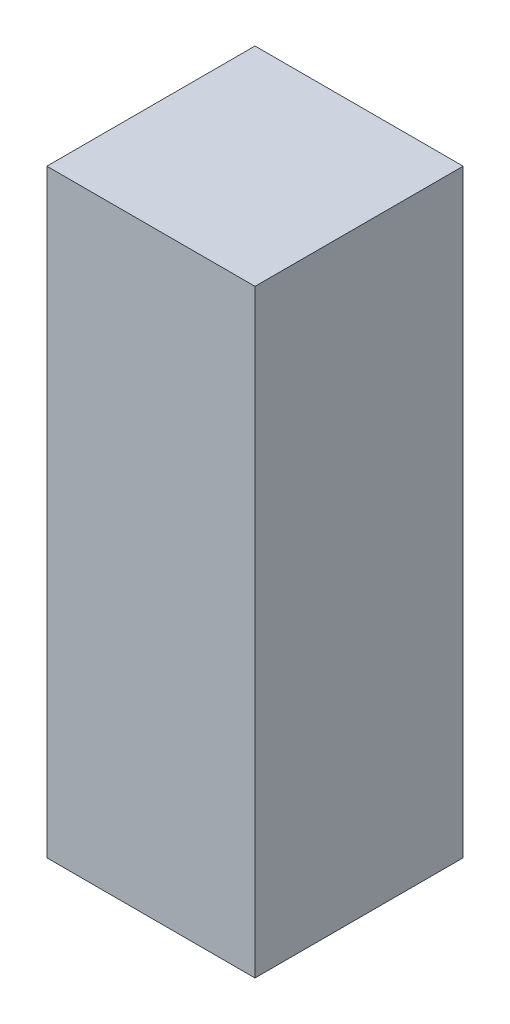
ISO-10303-21;
HEADER;
FILE_DESCRIPTION(('STEP AP214'),'2;1');
FILE_NAME('part.step','',(''),(''),'','','');
FILE_SCHEMA(('AUTOMOTIVE_DESIGN { 1 0 10303 214 1 1 1 1 }'));
ENDSEC;
DATA;
#1=APPLICATION_CONTEXT('core data for automotive mechanical design processes');
#2=APPLICATION_PROTOCOL_DEFINITION('international standard','automotive_design',2000,#1);
#3=PRODUCT_CONTEXT('',#1,'mechanical');
#4=PRODUCT('Part','Part','',(#3));
#5=PRODUCT_RELATED_PRODUCT_CATEGORY('part','',(#4));
#6=PRODUCT_DEFINITION_FORMATION('','',#4);
#7=PRODUCT_DEFINITION_CONTEXT('part definition',#1,'design');
#8=PRODUCT_DEFINITION('design','',#6,#7);
#9=PRODUCT_DEFINITION_SHAPE('','',#8);
#10=(LENGTH_UNIT() NAMED_UNIT(*) SI_UNIT(.MILLI.,.METRE.));
#11=(NAMED_UNIT(*) PLANE_ANGLE_UNIT() SI_UNIT($,.RADIAN.));
#12=(NAMED_UNIT(*) SI_UNIT($,.STERADIAN.) SOLID_ANGLE_UNIT());
#13=UNCERTAINTY_MEASURE_WITH_UNIT(LENGTH_MEASURE(1.E-05),#10,'distance_accuracy_value','');
#14=(GEOMETRIC_REPRESENTATION_CONTEXT(3) GLOBAL_UNCERTAINTY_ASSIGNED_CONTEXT((#13)) GLOBAL_UNIT_ASSIGNED_CONTEXT((#10,
#11,#12)) REPRESENTATION_CONTEXT('',''));
#15=CARTESIAN_POINT('',(0.,0.,0.));
#16=DIRECTION('',(0.,0.,1.));
#17=DIRECTION('',(1.,0.,0.));
#18=AXIS2_PLACEMENT_3D('',#15,#16,#17);
#19=CARTESIAN_POINT('',(-2.4384,-3.3909,-5.21335));
#20=DIRECTION('',(0.,-0.707106781186549,-0.707106781186546));
#21=DIRECTION('',(0.,0.707106781186546,-0.707106781186549));
#22=AXIS2_PLACEMENT_3D('',#19,#20,#21);
#23=PLANE('',#22);
#24=DIRECTION('',(1.,0.,0.));
#25=VECTOR('',#24,1.);
#26=CARTESIAN_POINT('',(-2.27965,-3.4544,-5.14985));
#27=LINE('',#26,#25);
#28=CARTESIAN_POINT('',(-2.47015,-3.4544,-5.14985));
#29=VERTEX_POINT('',#28);
#30=CARTESIAN_POINT('',(-2.08915,-3.4544,-5.14985));
#31=VERTEX_POINT('',#30);
#32=EDGE_CURVE('E20',#29,#31,#27,.T.);
#33=ORIENTED_EDGE('',*,*,#32,.F.);
#34=DIRECTION('',(0.577350269189627,-0.577350269189627,0.577350269189623));
#35=VECTOR('',#34,1.);
#36=CARTESIAN_POINT('',(-2.59715,-3.3274,-5.27685));
#37=LINE('',#36,#35);
#38=CARTESIAN_POINT('',(-2.59715,-3.3274,-5.27685));
#39=VERTEX_POINT('',#38);
#40=EDGE_CURVE('E71',#39,#29,#37,.T.);
#41=ORIENTED_EDGE('',*,*,#40,.F.);
#42=DIRECTION('',(-1.,0.,0.));
#43=VECTOR('',#42,1.);
#44=CARTESIAN_POINT('',(-2.59715,-3.3274,-5.27685));
#45=LINE('',#44,#43);
#46=CARTESIAN_POINT('',(-1.96215,-3.3274,-5.27685));
#47=VERTEX_POINT('',#46);
#48=EDGE_CURVE('E92',#47,#39,#45,.T.);
#49=ORIENTED_EDGE('',*,*,#48,.F.);
#50=DIRECTION('',(0.577350269189628,0.577350269189626,-0.577350269189624));
#51=VECTOR('',#50,1.);
#52=CARTESIAN_POINT('',(-2.08915,-3.4544,-5.14985));
#53=LINE('',#52,#51);
#54=EDGE_CURVE('E73',#31,#47,#53,.T.);
#55=ORIENTED_EDGE('',*,*,#54,.F.);
#56=EDGE_LOOP('',(#33,#41,#49,#55));
#57=FACE_BOUND('',#56,.T.);
#58=ADVANCED_FACE('F17',(#57),#23,.T.);
#59=CARTESIAN_POINT('',(-2.27965,-3.4544,-4.95935));
#60=DIRECTION('',(0.,-1.,0.));
#61=DIRECTION('',(0.,0.,-1.));
#62=AXIS2_PLACEMENT_3D('',#59,#60,#61);
#63=PLANE('',#62);
#64=DIRECTION('',(0.,0.,1.));
#65=VECTOR('',#64,1.);
#66=CARTESIAN_POINT('',(-2.08915,-3.4544,-5.1181));
#67=LINE('',#66,#65);
#68=CARTESIAN_POINT('',(-2.08915,-3.4544,-4.76885));
#69=VERTEX_POINT('',#68);
#70=EDGE_CURVE('E87',#69,#31,#67,.F.);
#71=ORIENTED_EDGE('',*,*,#70,.F.);
#72=DIRECTION('',(1.,0.,0.));
#73=VECTOR('',#72,1.);
#74=CARTESIAN_POINT('',(-2.1209,-3.4544,-4.76885));
#75=LINE('',#74,#73);
#76=CARTESIAN_POINT('',(-2.47015,-3.4544,-4.76885));
#77=VERTEX_POINT('',#76);
#78=EDGE_CURVE('E79',#77,#69,#75,.T.);
#79=ORIENTED_EDGE('',*,*,#78,.F.);
#80=DIRECTION('',(0.,0.,1.));
#81=VECTOR('',#80,1.);
#82=CARTESIAN_POINT('',(-2.47015,-3.4544,-4.8006));
#83=LINE('',#82,#81);
#84=EDGE_CURVE('E75',#29,#77,#83,.T.);
#85=ORIENTED_EDGE('',*,*,#84,.F.);
#86=ORIENTED_EDGE('',*,*,#32,.T.);
#87=EDGE_LOOP('',(#71,#79,#85,#86));
#88=FACE_BOUND('',#87,.T.);
#89=ADVANCED_FACE('F77',(#88),#63,.T.);
#90=CARTESIAN_POINT('',(-2.53365,-3.3909,-4.8006));
#91=DIRECTION('',(-0.707106781186548,-0.707106781186548,0.));
#92=DIRECTION('',(0.707106781186548,-0.707106781186548,0.));
#93=AXIS2_PLACEMENT_3D('',#90,#91,#92);
#94=PLANE('',#93);
#95=DIRECTION('',(0.,0.,1.));
#96=VECTOR('',#95,1.);
#97=CARTESIAN_POINT('',(-2.59715,-3.3274,-4.64185));
#98=LINE('',#97,#96);
#99=CARTESIAN_POINT('',(-2.59715,-3.3274,-4.64185));
#100=VERTEX_POINT('',#99);
#101=EDGE_CURVE('E85',#39,#100,#98,.T.);
#102=ORIENTED_EDGE('',*,*,#101,.F.);
#103=ORIENTED_EDGE('',*,*,#40,.T.);
#104=ORIENTED_EDGE('',*,*,#84,.T.);
#105=DIRECTION('',(0.577350269189628,-0.577350269189626,-0.577350269189624));
#106=VECTOR('',#105,1.);
#107=CARTESIAN_POINT('',(-2.59715,-3.3274,-4.64185));
#108=LINE('',#107,#106);
#109=EDGE_CURVE('E105',#100,#77,#108,.T.);
#110=ORIENTED_EDGE('',*,*,#109,.F.);
#111=EDGE_LOOP('',(#102,#103,#104,#110));
#112=FACE_BOUND('',#111,.T.);
#113=ADVANCED_FACE('F83',(#112),#94,.T.);
#114=CARTESIAN_POINT('',(-2.02565,-3.3909,-5.1181));
#115=DIRECTION('',(0.707106781186548,-0.707106781186548,0.));
#116=DIRECTION('',(0.707106781186548,0.707106781186548,0.));
#117=AXIS2_PLACEMENT_3D('',#114,#115,#116);
#118=PLANE('',#117);
#119=DIRECTION('',(0.,0.,-1.));
#120=VECTOR('',#119,1.);
#121=CARTESIAN_POINT('',(-1.96215,-3.3274,-5.27685));
#122=LINE('',#121,#120);
#123=CARTESIAN_POINT('',(-1.96215,-3.3274,-4.64185));
#124=VERTEX_POINT('',#123);
#125=EDGE_CURVE('E35',#124,#47,#122,.T.);
#126=ORIENTED_EDGE('',*,*,#125,.F.);
#127=DIRECTION('',(0.577350269189626,0.577350269189626,0.577350269189624));
#128=VECTOR('',#127,1.);
#129=CARTESIAN_POINT('',(-2.08915,-3.4544,-4.76885));
#130=LINE('',#129,#128);
#131=EDGE_CURVE('E103',#69,#124,#130,.T.);
#132=ORIENTED_EDGE('',*,*,#131,.F.);
#133=ORIENTED_EDGE('',*,*,#70,.T.);
#134=ORIENTED_EDGE('',*,*,#54,.T.);
#135=EDGE_LOOP('',(#126,#132,#133,#134));
#136=FACE_BOUND('',#135,.T.);
#137=ADVANCED_FACE('F139',(#136),#118,.T.);
#138=CARTESIAN_POINT('',(-2.59715,0.127,-5.27685));
#139=DIRECTION('',(0.,0.,-1.));
#140=DIRECTION('',(-1.,0.,0.));
#141=AXIS2_PLACEMENT_3D('',#138,#139,#140);
#142=PLANE('',#141);
#143=ORIENTED_EDGE('',*,*,#48,.T.);
#144=DIRECTION('',(0.,1.,0.));
#145=VECTOR('',#144,1.);
#146=CARTESIAN_POINT('',(-2.59715,0.127,-5.27685));
#147=LINE('',#146,#145);
#148=CARTESIAN_POINT('',(-2.59715,-1.4999999594414,-5.27685));
#149=VERTEX_POINT('',#148);
#150=EDGE_CURVE('E99',#149,#39,#147,.F.);
#151=ORIENTED_EDGE('',*,*,#150,.F.);
#152=DIRECTION('',(1.,0.,0.));
#153=VECTOR('',#152,1.);
#154=CARTESIAN_POINT('',(36.5829594414537,-1.4999999594414,-5.27685));
#155=LINE('',#154,#153);
#156=CARTESIAN_POINT('',(-1.96215,-1.4999999594414,-5.27685));
#157=VERTEX_POINT('',#156);
#158=EDGE_CURVE('E94',#149,#157,#155,.T.);
#159=ORIENTED_EDGE('',*,*,#158,.T.);
#160=DIRECTION('',(0.,1.,0.));
#161=VECTOR('',#160,1.);
#162=CARTESIAN_POINT('',(-1.96215,0.127,-5.27685));
#163=LINE('',#162,#161);
#164=EDGE_CURVE('E111',#47,#157,#163,.T.);
#165=ORIENTED_EDGE('',*,*,#164,.F.);
#166=EDGE_LOOP('',(#143,#151,#159,#165));
#167=FACE_BOUND('',#166,.T.);
#168=ADVANCED_FACE('F138',(#167),#142,.T.);
#169=CARTESIAN_POINT('',(36.5829594414537,-1.4999999594414,-7.17049999999999));
#170=DIRECTION('',(0.,-1.,0.));
#171=DIRECTION('',(0.,0.,-1.));
#172=AXIS2_PLACEMENT_3D('',#169,#170,#171);
#173=PLANE('',#172);
#174=DIRECTION('',(0.,0.,1.));
#175=VECTOR('',#174,1.);
#176=CARTESIAN_POINT('',(-2.59715,-1.4999999594414,-4.64185));
#177=LINE('',#176,#175);
#178=CARTESIAN_POINT('',(-2.59715,-1.4999999594414,-4.64185));
#179=VERTEX_POINT('',#178);
#180=EDGE_CURVE('E96',#179,#149,#177,.F.);
#181=ORIENTED_EDGE('',*,*,#180,.F.);
#182=DIRECTION('',(1.,0.,0.));
#183=VECTOR('',#182,1.);
#184=CARTESIAN_POINT('',(-1.96215,-1.4999999594414,-4.64185));
#185=LINE('',#184,#183);
#186=CARTESIAN_POINT('',(-1.96215,-1.4999999594414,-4.64185));
#187=VERTEX_POINT('',#186);
#188=EDGE_CURVE('E114',#187,#179,#185,.F.);
#189=ORIENTED_EDGE('',*,*,#188,.F.);
#190=DIRECTION('',(0.,0.,-1.));
#191=VECTOR('',#190,1.);
#192=CARTESIAN_POINT('',(-1.96215,-1.4999999594414,-5.27685));
#193=LINE('',#192,#191);
#194=EDGE_CURVE('E107',#157,#187,#193,.F.);
#195=ORIENTED_EDGE('',*,*,#194,.F.);
#196=ORIENTED_EDGE('',*,*,#158,.F.);
#197=EDGE_LOOP('',(#181,#189,#195,#196));
#198=FACE_BOUND('',#197,.T.);
#199=ADVANCED_FACE('F133',(#198),#173,.F.);
#200=CARTESIAN_POINT('',(-2.59715,0.127,-4.64185));
#201=DIRECTION('',(-1.,0.,0.));
#202=DIRECTION('',(0.,0.,1.));
#203=AXIS2_PLACEMENT_3D('',#200,#201,#202);
#204=PLANE('',#203);
#205=ORIENTED_EDGE('',*,*,#101,.T.);
#206=DIRECTION('',(0.,1.,0.));
#207=VECTOR('',#206,1.);
#208=CARTESIAN_POINT('',(-2.59715,0.127,-4.64185));
#209=LINE('',#208,#207);
#210=EDGE_CURVE('E117',#179,#100,#209,.F.);
#211=ORIENTED_EDGE('',*,*,#210,.F.);
#212=ORIENTED_EDGE('',*,*,#180,.T.);
#213=ORIENTED_EDGE('',*,*,#150,.T.);
#214=EDGE_LOOP('',(#205,#211,#212,#213));
#215=FACE_BOUND('',#214,.T.);
#216=ADVANCED_FACE('F136',(#215),#204,.T.);
#217=CARTESIAN_POINT('',(-2.1209,-3.3909,-4.70535));
#218=DIRECTION('',(0.,-0.707106781186548,0.707106781186548));
#219=DIRECTION('',(0.,-0.707106781186548,-0.707106781186548));
#220=AXIS2_PLACEMENT_3D('',#217,#218,#219);
#221=PLANE('',#220);
#222=DIRECTION('',(1.,0.,0.));
#223=VECTOR('',#222,1.);
#224=CARTESIAN_POINT('',(-1.96215,-3.3274,-4.64185));
#225=LINE('',#224,#223);
#226=EDGE_CURVE('E26',#100,#124,#225,.T.);
#227=ORIENTED_EDGE('',*,*,#226,.F.);
#228=ORIENTED_EDGE('',*,*,#109,.T.);
#229=ORIENTED_EDGE('',*,*,#78,.T.);
#230=ORIENTED_EDGE('',*,*,#131,.T.);
#231=EDGE_LOOP('',(#227,#228,#229,#230));
#232=FACE_BOUND('',#231,.T.);
#233=ADVANCED_FACE('F127',(#232),#221,.T.);
#234=CARTESIAN_POINT('',(-1.96215,0.127,-5.27685));
#235=DIRECTION('',(1.,0.,0.));
#236=DIRECTION('',(0.,0.,-1.));
#237=AXIS2_PLACEMENT_3D('',#234,#235,#236);
#238=PLANE('',#237);
#239=ORIENTED_EDGE('',*,*,#125,.T.);
#240=ORIENTED_EDGE('',*,*,#164,.T.);
#241=ORIENTED_EDGE('',*,*,#194,.T.);
#242=DIRECTION('',(0.,1.,0.));
#243=VECTOR('',#242,1.);
#244=CARTESIAN_POINT('',(-1.96215,0.127,-4.64185));
#245=LINE('',#244,#243);
#246=EDGE_CURVE('E11',#124,#187,#245,.T.);
#247=ORIENTED_EDGE('',*,*,#246,.F.);
#248=EDGE_LOOP('',(#239,#240,#241,#247));
#249=FACE_BOUND('',#248,.T.);
#250=ADVANCED_FACE('F129',(#249),#238,.T.);
#251=CARTESIAN_POINT('',(-1.96215,0.127,-4.64185));
#252=DIRECTION('',(0.,0.,1.));
#253=DIRECTION('',(1.,0.,0.));
#254=AXIS2_PLACEMENT_3D('',#251,#252,#253);
#255=PLANE('',#254);
#256=ORIENTED_EDGE('',*,*,#226,.T.);
#257=ORIENTED_EDGE('',*,*,#246,.T.);
#258=ORIENTED_EDGE('',*,*,#188,.T.);
#259=ORIENTED_EDGE('',*,*,#210,.T.);
#260=EDGE_LOOP('',(#256,#257,#258,#259));
#261=FACE_BOUND('',#260,.T.);
#262=ADVANCED_FACE('F123',(#261),#255,.T.);
#263=CLOSED_SHELL('',(#58,#89,#113,#137,#168,#199,#216,#233,#250,#262));
#264=MANIFOLD_SOLID_BREP('B1',#263);
#265=ADVANCED_BREP_SHAPE_REPRESENTATION('',(#18,#264),#14);
#266=SHAPE_DEFINITION_REPRESENTATION(#9,#265);
ENDSEC;
END-ISO-10303-21;
